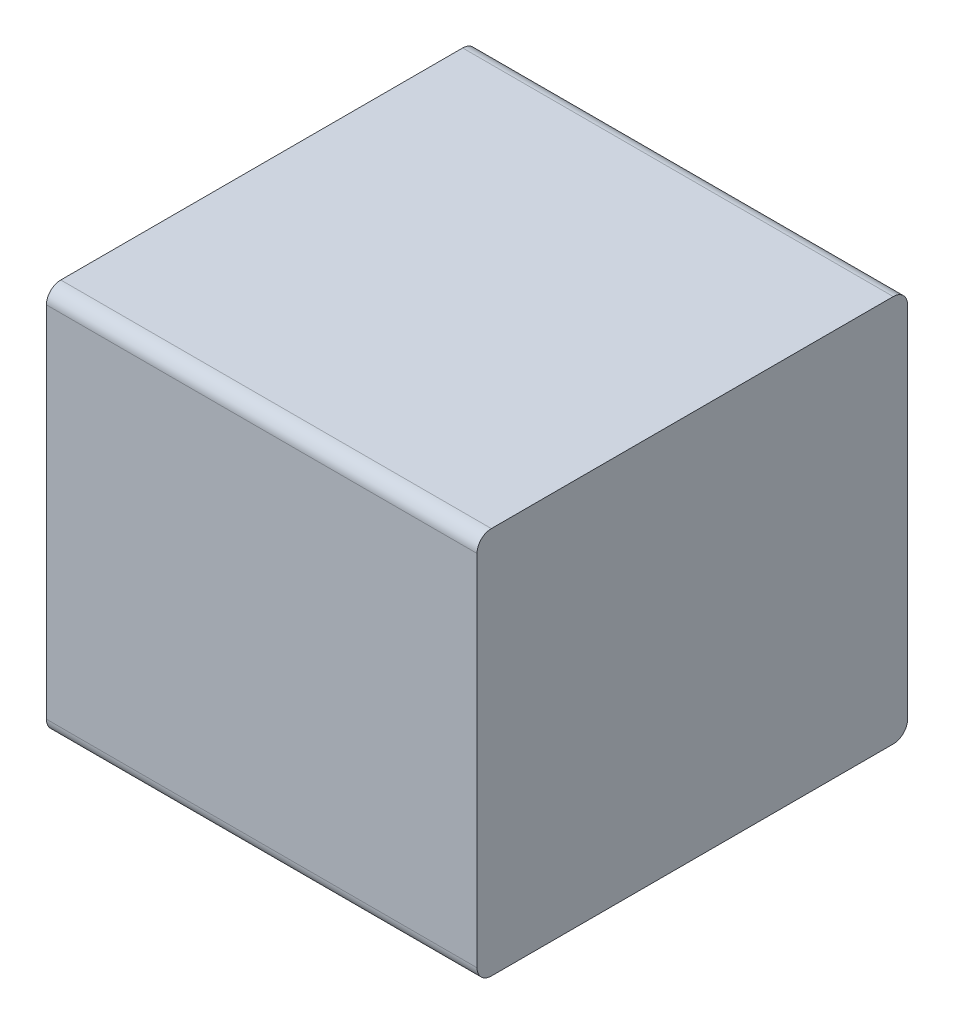
ISO-10303-21;
HEADER;
FILE_DESCRIPTION(('STEP AP214'),'2;1');
FILE_NAME('part.step','',(''),(''),'','','');
FILE_SCHEMA(('AUTOMOTIVE_DESIGN { 1 0 10303 214 1 1 1 1 }'));
ENDSEC;
DATA;
#1=APPLICATION_CONTEXT('core data for automotive mechanical design processes');
#2=APPLICATION_PROTOCOL_DEFINITION('international standard','automotive_design',2000,#1);
#3=PRODUCT_CONTEXT('',#1,'mechanical');
#4=PRODUCT('Part','Part','',(#3));
#5=PRODUCT_RELATED_PRODUCT_CATEGORY('part','',(#4));
#6=PRODUCT_DEFINITION_FORMATION('','',#4);
#7=PRODUCT_DEFINITION_CONTEXT('part definition',#1,'design');
#8=PRODUCT_DEFINITION('design','',#6,#7);
#9=PRODUCT_DEFINITION_SHAPE('','',#8);
#10=(LENGTH_UNIT() NAMED_UNIT(*) SI_UNIT(.MILLI.,.METRE.));
#11=(NAMED_UNIT(*) PLANE_ANGLE_UNIT() SI_UNIT($,.RADIAN.));
#12=(NAMED_UNIT(*) SI_UNIT($,.STERADIAN.) SOLID_ANGLE_UNIT());
#13=UNCERTAINTY_MEASURE_WITH_UNIT(LENGTH_MEASURE(1.E-05),#10,'distance_accuracy_value','');
#14=(GEOMETRIC_REPRESENTATION_CONTEXT(3) GLOBAL_UNCERTAINTY_ASSIGNED_CONTEXT((#13)) GLOBAL_UNIT_ASSIGNED_CONTEXT((#10,
#11,#12)) REPRESENTATION_CONTEXT('',''));
#15=CARTESIAN_POINT('',(0.,0.,0.));
#16=DIRECTION('',(0.,0.,1.));
#17=DIRECTION('',(1.,0.,0.));
#18=AXIS2_PLACEMENT_3D('',#15,#16,#17);
#19=CARTESIAN_POINT('',(-0.4,-0.375,0.03));
#20=DIRECTION('',(-1.,0.,0.));
#21=DIRECTION('',(0.,-0.707106781186548,-0.707106781186547));
#22=AXIS2_PLACEMENT_3D('',#19,#20,#21);
#23=CYLINDRICAL_SURFACE('',#22,0.03);
#24=CARTESIAN_POINT('',(-0.45,-0.375,0.03));
#25=DIRECTION('',(1.,0.,0.));
#26=DIRECTION('',(0.,-0.707106781186548,-0.707106781186547));
#27=AXIS2_PLACEMENT_3D('',#24,#25,#26);
#28=CIRCLE('',#27,0.03);
#29=CARTESIAN_POINT('',(-0.45,-0.405,0.03));
#30=VERTEX_POINT('',#29);
#31=CARTESIAN_POINT('',(-0.45,-0.375,0.));
#32=VERTEX_POINT('',#31);
#33=EDGE_CURVE('E11',#30,#32,#28,.T.);
#34=ORIENTED_EDGE('',*,*,#33,.T.);
#35=DIRECTION('',(1.,0.,0.));
#36=VECTOR('',#35,1.);
#37=CARTESIAN_POINT('',(-0.4,-0.375,0.));
#38=LINE('',#37,#36);
#39=CARTESIAN_POINT('',(0.45,-0.375,0.));
#40=VERTEX_POINT('',#39);
#41=EDGE_CURVE('E24',#32,#40,#38,.T.);
#42=ORIENTED_EDGE('',*,*,#41,.T.);
#43=CARTESIAN_POINT('',(0.45,-0.375,0.03));
#44=DIRECTION('',(-1.,0.,0.));
#45=DIRECTION('',(0.,-0.707106781186548,-0.707106781186547));
#46=AXIS2_PLACEMENT_3D('',#43,#44,#45);
#47=CIRCLE('',#46,0.03);
#48=CARTESIAN_POINT('',(0.45,-0.405,0.03));
#49=VERTEX_POINT('',#48);
#50=EDGE_CURVE('E144',#40,#49,#47,.T.);
#51=ORIENTED_EDGE('',*,*,#50,.T.);
#52=DIRECTION('',(-1.,0.,0.));
#53=VECTOR('',#52,1.);
#54=CARTESIAN_POINT('',(-0.4,-0.405,0.03));
#55=LINE('',#54,#53);
#56=EDGE_CURVE('E142',#49,#30,#55,.T.);
#57=ORIENTED_EDGE('',*,*,#56,.T.);
#58=EDGE_LOOP('',(#34,#42,#51,#57));
#59=FACE_BOUND('',#58,.T.);
#60=ADVANCED_FACE('F17',(#59),#23,.T.);
#61=CARTESIAN_POINT('',(-0.8,-0.405,0.));
#62=DIRECTION('',(0.,-1.,0.));
#63=DIRECTION('',(1.,0.,0.));
#64=AXIS2_PLACEMENT_3D('',#61,#62,#63);
#65=PLANE('',#64);
#66=ORIENTED_EDGE('',*,*,#56,.F.);
#67=DIRECTION('',(0.,0.,1.));
#68=VECTOR('',#67,1.);
#69=CARTESIAN_POINT('',(0.45,-0.405,0.225));
#70=LINE('',#69,#68);
#71=CARTESIAN_POINT('',(0.45,-0.405,0.87));
#72=VERTEX_POINT('',#71);
#73=EDGE_CURVE('E140',#49,#72,#70,.T.);
#74=ORIENTED_EDGE('',*,*,#73,.T.);
#75=DIRECTION('',(1.,0.,0.));
#76=VECTOR('',#75,1.);
#77=CARTESIAN_POINT('',(-0.4,-0.405,0.87));
#78=LINE('',#77,#76);
#79=CARTESIAN_POINT('',(-0.45,-0.405,0.87));
#80=VERTEX_POINT('',#79);
#81=EDGE_CURVE('E137',#80,#72,#78,.T.);
#82=ORIENTED_EDGE('',*,*,#81,.F.);
#83=DIRECTION('',(0.,0.,-1.));
#84=VECTOR('',#83,1.);
#85=CARTESIAN_POINT('',(-0.45,-0.405,0.225));
#86=LINE('',#85,#84);
#87=EDGE_CURVE('E134',#80,#30,#86,.T.);
#88=ORIENTED_EDGE('',*,*,#87,.T.);
#89=EDGE_LOOP('',(#66,#74,#82,#88));
#90=FACE_BOUND('',#89,.T.);
#91=ADVANCED_FACE('F163',(#90),#65,.T.);
#92=CARTESIAN_POINT('',(0.45,0.,0.45));
#93=DIRECTION('',(-1.,0.,0.));
#94=DIRECTION('',(0.,0.,1.));
#95=AXIS2_PLACEMENT_3D('',#92,#93,#94);
#96=PLANE('',#95);
#97=ORIENTED_EDGE('',*,*,#50,.F.);
#98=DIRECTION('',(0.,-1.,0.));
#99=VECTOR('',#98,1.);
#100=CARTESIAN_POINT('',(0.45,0.,0.));
#101=LINE('',#100,#99);
#102=CARTESIAN_POINT('',(0.45,0.375,0.));
#103=VERTEX_POINT('',#102);
#104=EDGE_CURVE('E131',#103,#40,#101,.T.);
#105=ORIENTED_EDGE('',*,*,#104,.F.);
#106=CARTESIAN_POINT('',(0.45,0.375,0.03));
#107=DIRECTION('',(-1.,0.,0.));
#108=DIRECTION('',(0.,0.707106781186548,-0.707106781186547));
#109=AXIS2_PLACEMENT_3D('',#106,#107,#108);
#110=CIRCLE('',#109,0.03);
#111=CARTESIAN_POINT('',(0.45,0.405,0.03));
#112=VERTEX_POINT('',#111);
#113=EDGE_CURVE('E128',#112,#103,#110,.T.);
#114=ORIENTED_EDGE('',*,*,#113,.F.);
#115=DIRECTION('',(0.,0.,-1.));
#116=VECTOR('',#115,1.);
#117=CARTESIAN_POINT('',(0.45,0.405,0.225));
#118=LINE('',#117,#116);
#119=CARTESIAN_POINT('',(0.45,0.405,0.87));
#120=VERTEX_POINT('',#119);
#121=EDGE_CURVE('E125',#120,#112,#118,.T.);
#122=ORIENTED_EDGE('',*,*,#121,.F.);
#123=CARTESIAN_POINT('',(0.45,0.375,0.87));
#124=DIRECTION('',(-1.,0.,0.));
#125=DIRECTION('',(0.,0.707106781186548,0.707106781186548));
#126=AXIS2_PLACEMENT_3D('',#123,#124,#125);
#127=CIRCLE('',#126,0.03);
#128=CARTESIAN_POINT('',(0.45,0.375,0.9));
#129=VERTEX_POINT('',#128);
#130=EDGE_CURVE('E123',#129,#120,#127,.T.);
#131=ORIENTED_EDGE('',*,*,#130,.F.);
#132=DIRECTION('',(0.,1.,0.));
#133=VECTOR('',#132,1.);
#134=CARTESIAN_POINT('',(0.45,0.,0.9));
#135=LINE('',#134,#133);
#136=CARTESIAN_POINT('',(0.45,-0.375,0.9));
#137=VERTEX_POINT('',#136);
#138=EDGE_CURVE('E101',#137,#129,#135,.T.);
#139=ORIENTED_EDGE('',*,*,#138,.F.);
#140=CARTESIAN_POINT('',(0.45,-0.375,0.87));
#141=DIRECTION('',(-1.,0.,0.));
#142=DIRECTION('',(0.,-0.707106781186548,0.707106781186548));
#143=AXIS2_PLACEMENT_3D('',#140,#141,#142);
#144=CIRCLE('',#143,0.03);
#145=EDGE_CURVE('E119',#72,#137,#144,.T.);
#146=ORIENTED_EDGE('',*,*,#145,.F.);
#147=ORIENTED_EDGE('',*,*,#73,.F.);
#148=EDGE_LOOP('',(#97,#105,#114,#122,#131,#139,#146,#147));
#149=FACE_BOUND('',#148,.T.);
#150=ADVANCED_FACE('F150',(#149),#96,.F.);
#151=CARTESIAN_POINT('',(0.4,0.375,0.03));
#152=DIRECTION('',(1.,0.,0.));
#153=DIRECTION('',(0.,0.707106781186548,-0.707106781186547));
#154=AXIS2_PLACEMENT_3D('',#151,#152,#153);
#155=CYLINDRICAL_SURFACE('',#154,0.03);
#156=ORIENTED_EDGE('',*,*,#113,.T.);
#157=DIRECTION('',(-1.,0.,0.));
#158=VECTOR('',#157,1.);
#159=CARTESIAN_POINT('',(0.4,0.375,0.));
#160=LINE('',#159,#158);
#161=CARTESIAN_POINT('',(-0.45,0.375,0.));
#162=VERTEX_POINT('',#161);
#163=EDGE_CURVE('E117',#103,#162,#160,.T.);
#164=ORIENTED_EDGE('',*,*,#163,.T.);
#165=CARTESIAN_POINT('',(-0.45,0.375,0.03));
#166=DIRECTION('',(1.,0.,0.));
#167=DIRECTION('',(0.,0.707106781186548,-0.707106781186547));
#168=AXIS2_PLACEMENT_3D('',#165,#166,#167);
#169=CIRCLE('',#168,0.03);
#170=CARTESIAN_POINT('',(-0.45,0.405,0.03));
#171=VERTEX_POINT('',#170);
#172=EDGE_CURVE('E115',#162,#171,#169,.T.);
#173=ORIENTED_EDGE('',*,*,#172,.T.);
#174=DIRECTION('',(1.,0.,0.));
#175=VECTOR('',#174,1.);
#176=CARTESIAN_POINT('',(0.4,0.405,0.03));
#177=LINE('',#176,#175);
#178=EDGE_CURVE('E112',#171,#112,#177,.T.);
#179=ORIENTED_EDGE('',*,*,#178,.T.);
#180=EDGE_LOOP('',(#156,#164,#173,#179));
#181=FACE_BOUND('',#180,.T.);
#182=ADVANCED_FACE('F156',(#181),#155,.T.);
#183=CARTESIAN_POINT('',(0.8,0.405,0.));
#184=DIRECTION('',(0.,1.,0.));
#185=DIRECTION('',(-1.,0.,0.));
#186=AXIS2_PLACEMENT_3D('',#183,#184,#185);
#187=PLANE('',#186);
#188=ORIENTED_EDGE('',*,*,#178,.F.);
#189=DIRECTION('',(0.,0.,1.));
#190=VECTOR('',#189,1.);
#191=CARTESIAN_POINT('',(-0.45,0.405,0.225));
#192=LINE('',#191,#190);
#193=CARTESIAN_POINT('',(-0.45,0.405,0.87));
#194=VERTEX_POINT('',#193);
#195=EDGE_CURVE('E110',#171,#194,#192,.T.);
#196=ORIENTED_EDGE('',*,*,#195,.T.);
#197=DIRECTION('',(-1.,0.,0.));
#198=VECTOR('',#197,1.);
#199=CARTESIAN_POINT('',(0.4,0.405,0.87));
#200=LINE('',#199,#198);
#201=EDGE_CURVE('E96',#120,#194,#200,.T.);
#202=ORIENTED_EDGE('',*,*,#201,.F.);
#203=ORIENTED_EDGE('',*,*,#121,.T.);
#204=EDGE_LOOP('',(#188,#196,#202,#203));
#205=FACE_BOUND('',#204,.T.);
#206=ADVANCED_FACE('F159',(#205),#187,.T.);
#207=CARTESIAN_POINT('',(-0.45,0.,0.45));
#208=DIRECTION('',(-1.,0.,0.));
#209=DIRECTION('',(0.,0.,1.));
#210=AXIS2_PLACEMENT_3D('',#207,#208,#209);
#211=PLANE('',#210);
#212=ORIENTED_EDGE('',*,*,#33,.F.);
#213=ORIENTED_EDGE('',*,*,#87,.F.);
#214=CARTESIAN_POINT('',(-0.45,-0.375,0.87));
#215=DIRECTION('',(1.,0.,0.));
#216=DIRECTION('',(0.,-0.707106781186548,0.707106781186548));
#217=AXIS2_PLACEMENT_3D('',#214,#215,#216);
#218=CIRCLE('',#217,0.03);
#219=CARTESIAN_POINT('',(-0.45,-0.375,0.9));
#220=VERTEX_POINT('',#219);
#221=EDGE_CURVE('E83',#220,#80,#218,.T.);
#222=ORIENTED_EDGE('',*,*,#221,.F.);
#223=DIRECTION('',(0.,-1.,0.));
#224=VECTOR('',#223,1.);
#225=CARTESIAN_POINT('',(-0.45,0.,0.9));
#226=LINE('',#225,#224);
#227=CARTESIAN_POINT('',(-0.45,0.375,0.9));
#228=VERTEX_POINT('',#227);
#229=EDGE_CURVE('E77',#228,#220,#226,.T.);
#230=ORIENTED_EDGE('',*,*,#229,.F.);
#231=CARTESIAN_POINT('',(-0.45,0.375,0.87));
#232=DIRECTION('',(1.,0.,0.));
#233=DIRECTION('',(0.,0.707106781186548,0.707106781186548));
#234=AXIS2_PLACEMENT_3D('',#231,#232,#233);
#235=CIRCLE('',#234,0.03);
#236=EDGE_CURVE('E81',#194,#228,#235,.T.);
#237=ORIENTED_EDGE('',*,*,#236,.F.);
#238=ORIENTED_EDGE('',*,*,#195,.F.);
#239=ORIENTED_EDGE('',*,*,#172,.F.);
#240=DIRECTION('',(0.,1.,0.));
#241=VECTOR('',#240,1.);
#242=CARTESIAN_POINT('',(-0.45,0.,0.));
#243=LINE('',#242,#241);
#244=EDGE_CURVE('E97',#32,#162,#243,.T.);
#245=ORIENTED_EDGE('',*,*,#244,.F.);
#246=EDGE_LOOP('',(#212,#213,#222,#230,#237,#238,#239,#245));
#247=FACE_BOUND('',#246,.T.);
#248=ADVANCED_FACE('F79',(#247),#211,.T.);
#249=CARTESIAN_POINT('',(0.4,0.375,0.87));
#250=DIRECTION('',(-1.,0.,0.));
#251=DIRECTION('',(0.,0.707106781186548,0.707106781186548));
#252=AXIS2_PLACEMENT_3D('',#249,#250,#251);
#253=CYLINDRICAL_SURFACE('',#252,0.03);
#254=ORIENTED_EDGE('',*,*,#236,.T.);
#255=DIRECTION('',(1.,0.,0.));
#256=VECTOR('',#255,1.);
#257=CARTESIAN_POINT('',(0.4,0.375,0.9));
#258=LINE('',#257,#256);
#259=EDGE_CURVE('E94',#228,#129,#258,.T.);
#260=ORIENTED_EDGE('',*,*,#259,.T.);
#261=ORIENTED_EDGE('',*,*,#130,.T.);
#262=ORIENTED_EDGE('',*,*,#201,.T.);
#263=EDGE_LOOP('',(#254,#260,#261,#262));
#264=FACE_BOUND('',#263,.T.);
#265=ADVANCED_FACE('F92',(#264),#253,.T.);
#266=CARTESIAN_POINT('',(0.,0.,0.9));
#267=DIRECTION('',(0.,0.,1.));
#268=DIRECTION('',(1.,0.,0.));
#269=AXIS2_PLACEMENT_3D('',#266,#267,#268);
#270=PLANE('',#269);
#271=ORIENTED_EDGE('',*,*,#259,.F.);
#272=ORIENTED_EDGE('',*,*,#229,.T.);
#273=DIRECTION('',(-1.,0.,0.));
#274=VECTOR('',#273,1.);
#275=CARTESIAN_POINT('',(-0.4,-0.375,0.9));
#276=LINE('',#275,#274);
#277=EDGE_CURVE('E102',#137,#220,#276,.T.);
#278=ORIENTED_EDGE('',*,*,#277,.F.);
#279=ORIENTED_EDGE('',*,*,#138,.T.);
#280=EDGE_LOOP('',(#271,#272,#278,#279));
#281=FACE_BOUND('',#280,.T.);
#282=ADVANCED_FACE('F100',(#281),#270,.T.);
#283=CARTESIAN_POINT('',(-0.4,-0.375,0.87));
#284=DIRECTION('',(1.,0.,0.));
#285=DIRECTION('',(0.,-0.707106781186548,0.707106781186548));
#286=AXIS2_PLACEMENT_3D('',#283,#284,#285);
#287=CYLINDRICAL_SURFACE('',#286,0.03);
#288=ORIENTED_EDGE('',*,*,#145,.T.);
#289=ORIENTED_EDGE('',*,*,#277,.T.);
#290=ORIENTED_EDGE('',*,*,#221,.T.);
#291=ORIENTED_EDGE('',*,*,#81,.T.);
#292=EDGE_LOOP('',(#288,#289,#290,#291));
#293=FACE_BOUND('',#292,.T.);
#294=ADVANCED_FACE('F161',(#293),#287,.T.);
#295=CARTESIAN_POINT('',(0.,0.,0.));
#296=DIRECTION('',(0.,0.,1.));
#297=DIRECTION('',(1.,0.,0.));
#298=AXIS2_PLACEMENT_3D('',#295,#296,#297);
#299=PLANE('',#298);
#300=ORIENTED_EDGE('',*,*,#41,.F.);
#301=ORIENTED_EDGE('',*,*,#244,.T.);
#302=ORIENTED_EDGE('',*,*,#163,.F.);
#303=ORIENTED_EDGE('',*,*,#104,.T.);
#304=EDGE_LOOP('',(#300,#301,#302,#303));
#305=FACE_BOUND('',#304,.T.);
#306=ADVANCED_FACE('F153',(#305),#299,.F.);
#307=CLOSED_SHELL('',(#60,#91,#150,#182,#206,#248,#265,#282,#294,#306));
#308=MANIFOLD_SOLID_BREP('B1',#307);
#309=ADVANCED_BREP_SHAPE_REPRESENTATION('',(#18,#308),#14);
#310=SHAPE_DEFINITION_REPRESENTATION(#9,#309);
ENDSEC;
END-ISO-10303-21;
